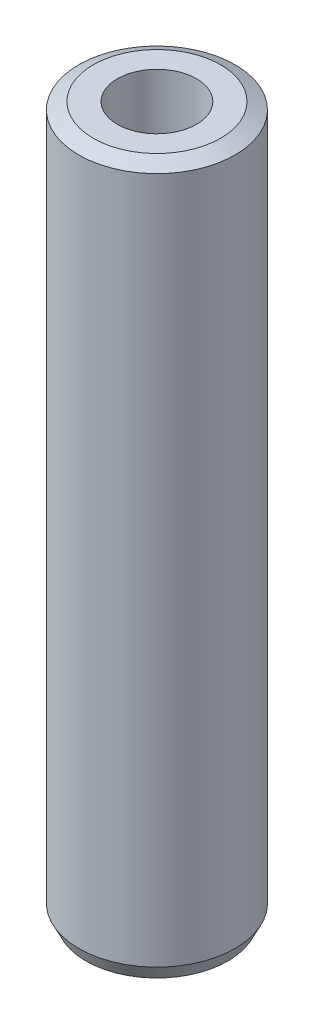
ISO-10303-21;
HEADER;
FILE_DESCRIPTION(('STEP AP214'),'2;1');
FILE_NAME('part.step','',(''),(''),'','','');
FILE_SCHEMA(('AUTOMOTIVE_DESIGN { 1 0 10303 214 1 1 1 1 }'));
ENDSEC;
DATA;
#1=APPLICATION_CONTEXT('core data for automotive mechanical design processes');
#2=APPLICATION_PROTOCOL_DEFINITION('international standard','automotive_design',2000,#1);
#3=PRODUCT_CONTEXT('',#1,'mechanical');
#4=PRODUCT('Part','Part','',(#3));
#5=PRODUCT_RELATED_PRODUCT_CATEGORY('part','',(#4));
#6=PRODUCT_DEFINITION_FORMATION('','',#4);
#7=PRODUCT_DEFINITION_CONTEXT('part definition',#1,'design');
#8=PRODUCT_DEFINITION('design','',#6,#7);
#9=PRODUCT_DEFINITION_SHAPE('','',#8);
#10=(LENGTH_UNIT() NAMED_UNIT(*) SI_UNIT(.MILLI.,.METRE.));
#11=(NAMED_UNIT(*) PLANE_ANGLE_UNIT() SI_UNIT($,.RADIAN.));
#12=(NAMED_UNIT(*) SI_UNIT($,.STERADIAN.) SOLID_ANGLE_UNIT());
#13=UNCERTAINTY_MEASURE_WITH_UNIT(LENGTH_MEASURE(1.E-05),#10,'distance_accuracy_value','');
#14=(GEOMETRIC_REPRESENTATION_CONTEXT(3) GLOBAL_UNCERTAINTY_ASSIGNED_CONTEXT((#13)) GLOBAL_UNIT_ASSIGNED_CONTEXT((#10,
#11,#12)) REPRESENTATION_CONTEXT('',''));
#15=CARTESIAN_POINT('',(0.,0.,0.));
#16=DIRECTION('',(0.,0.,1.));
#17=DIRECTION('',(1.,0.,0.));
#18=AXIS2_PLACEMENT_3D('',#15,#16,#17);
#19=CARTESIAN_POINT('',(0.,430.662476989384,0.));
#20=DIRECTION('',(0.,-1.,0.));
#21=DIRECTION('',(0.,0.,-1.));
#22=AXIS2_PLACEMENT_3D('',#19,#20,#21);
#23=CYLINDRICAL_SURFACE('',#22,47.5);
#24=CARTESIAN_POINT('',(0.,426.29391592309,0.));
#25=DIRECTION('',(0.,1.,0.));
#26=DIRECTION('',(0.,0.,1.));
#27=AXIS2_PLACEMENT_3D('',#24,#25,#26);
#28=CIRCLE('',#27,47.5);
#29=CARTESIAN_POINT('',(0.,426.29391592309,47.5));
#30=VERTEX_POINT('',#29);
#31=EDGE_CURVE('E50',#30,#30,#28,.F.);
#32=ORIENTED_EDGE('',*,*,#31,.T.);
#33=EDGE_LOOP('',(#32));
#34=FACE_BOUND('',#33,.T.);
#35=CARTESIAN_POINT('',(0.,8.80779996335784,0.));
#36=DIRECTION('',(0.,1.,0.));
#37=DIRECTION('',(0.,0.,1.));
#38=AXIS2_PLACEMENT_3D('',#35,#36,#37);
#39=CIRCLE('',#38,47.5);
#40=CARTESIAN_POINT('',(0.,8.80779996335784,47.5));
#41=VERTEX_POINT('',#40);
#42=EDGE_CURVE('E51',#41,#41,#39,.T.);
#43=ORIENTED_EDGE('',*,*,#42,.T.);
#44=EDGE_LOOP('',(#43));
#45=FACE_BOUND('',#44,.T.);
#46=ADVANCED_FACE('F39',(#34,#45),#23,.T.);
#47=CARTESIAN_POINT('',(0.,430.662476989384,0.));
#48=DIRECTION('',(0.,1.,0.));
#49=DIRECTION('',(0.,0.,1.));
#50=AXIS2_PLACEMENT_3D('',#47,#48,#49);
#51=PLANE('',#50);
#52=CARTESIAN_POINT('',(0.,430.662476989384,0.));
#53=DIRECTION('',(0.,1.,0.));
#54=DIRECTION('',(0.,0.,1.));
#55=AXIS2_PLACEMENT_3D('',#52,#53,#54);
#56=CIRCLE('',#55,38.692200036642);
#57=CARTESIAN_POINT('',(0.,430.662476989384,38.692200036642));
#58=VERTEX_POINT('',#57);
#59=EDGE_CURVE('E54',#58,#58,#56,.T.);
#60=ORIENTED_EDGE('',*,*,#59,.T.);
#61=EDGE_LOOP('',(#60));
#62=FACE_BOUND('',#61,.T.);
#63=CARTESIAN_POINT('',(0.,430.662476989384,0.));
#64=DIRECTION('',(0.,1.,0.));
#65=DIRECTION('',(0.,0.,1.));
#66=AXIS2_PLACEMENT_3D('',#63,#64,#65);
#67=CIRCLE('',#66,24.0242565523685);
#68=CARTESIAN_POINT('',(0.,430.662476989384,24.0242565523685));
#69=VERTEX_POINT('',#68);
#70=EDGE_CURVE('E58',#69,#69,#67,.T.);
#71=ORIENTED_EDGE('',*,*,#70,.F.);
#72=EDGE_LOOP('',(#71));
#73=FACE_BOUND('',#72,.T.);
#74=ADVANCED_FACE('F69',(#62,#73),#51,.T.);
#75=CARTESIAN_POINT('',(0.,0.,0.));
#76=DIRECTION('',(0.,1.,0.));
#77=DIRECTION('',(0.,0.,1.));
#78=AXIS2_PLACEMENT_3D('',#75,#76,#77);
#79=PLANE('',#78);
#80=CARTESIAN_POINT('',(0.,0.,0.));
#81=DIRECTION('',(0.,1.,0.));
#82=DIRECTION('',(0.,0.,1.));
#83=AXIS2_PLACEMENT_3D('',#80,#81,#82);
#84=CIRCLE('',#83,43.1314389337068);
#85=CARTESIAN_POINT('',(0.,0.,43.1314389337068));
#86=VERTEX_POINT('',#85);
#87=EDGE_CURVE('E10',#86,#86,#84,.F.);
#88=ORIENTED_EDGE('',*,*,#87,.T.);
#89=EDGE_LOOP('',(#88));
#90=FACE_BOUND('',#89,.T.);
#91=CARTESIAN_POINT('',(0.,0.,0.));
#92=DIRECTION('',(0.,1.,0.));
#93=DIRECTION('',(0.,0.,1.));
#94=AXIS2_PLACEMENT_3D('',#91,#92,#93);
#95=CIRCLE('',#94,24.0242565523685);
#96=CARTESIAN_POINT('',(0.,0.,24.0242565523685));
#97=VERTEX_POINT('',#96);
#98=EDGE_CURVE('E63',#97,#97,#95,.T.);
#99=ORIENTED_EDGE('',*,*,#98,.T.);
#100=EDGE_LOOP('',(#99));
#101=FACE_BOUND('',#100,.T.);
#102=ADVANCED_FACE('F75',(#90,#101),#79,.F.);
#103=CARTESIAN_POINT('',(0.,430.662476989384,0.));
#104=DIRECTION('',(0.,-1.,0.));
#105=DIRECTION('',(0.,0.,-1.));
#106=AXIS2_PLACEMENT_3D('',#103,#104,#105);
#107=CYLINDRICAL_SURFACE('',#106,24.0242565523685);
#108=ORIENTED_EDGE('',*,*,#70,.T.);
#109=EDGE_LOOP('',(#108));
#110=FACE_BOUND('',#109,.T.);
#111=ORIENTED_EDGE('',*,*,#98,.F.);
#112=EDGE_LOOP('',(#111));
#113=FACE_BOUND('',#112,.T.);
#114=ADVANCED_FACE('F70',(#110,#113),#107,.F.);
#115=CARTESIAN_POINT('',(0.,430.662476989384,0.));
#116=DIRECTION('',(0.,-1.,0.));
#117=DIRECTION('',(0.,0.,-1.));
#118=AXIS2_PLACEMENT_3D('',#115,#116,#117);
#119=CONICAL_SURFACE('',#118,38.692200036642,1.11036365000323);
#120=ORIENTED_EDGE('',*,*,#31,.F.);
#121=EDGE_LOOP('',(#120));
#122=FACE_BOUND('',#121,.T.);
#123=ORIENTED_EDGE('',*,*,#59,.F.);
#124=EDGE_LOOP('',(#123));
#125=FACE_BOUND('',#124,.T.);
#126=ADVANCED_FACE('F81',(#122,#125),#119,.T.);
#127=CARTESIAN_POINT('',(0.,8.80779996335784,0.));
#128=DIRECTION('',(0.,1.,0.));
#129=DIRECTION('',(0.,0.,1.));
#130=AXIS2_PLACEMENT_3D('',#127,#128,#129);
#131=CONICAL_SURFACE('',#130,47.5,0.46043267679166);
#132=ORIENTED_EDGE('',*,*,#87,.F.);
#133=EDGE_LOOP('',(#132));
#134=FACE_BOUND('',#133,.T.);
#135=ORIENTED_EDGE('',*,*,#42,.F.);
#136=EDGE_LOOP('',(#135));
#137=FACE_BOUND('',#136,.T.);
#138=ADVANCED_FACE('F45',(#134,#137),#131,.T.);
#139=CLOSED_SHELL('',(#46,#74,#102,#114,#126,#138));
#140=MANIFOLD_SOLID_BREP('B2',#139);
#141=ADVANCED_BREP_SHAPE_REPRESENTATION('',(#18,#140),#14);
#142=SHAPE_DEFINITION_REPRESENTATION(#9,#141);
ENDSEC;
END-ISO-10303-21;
